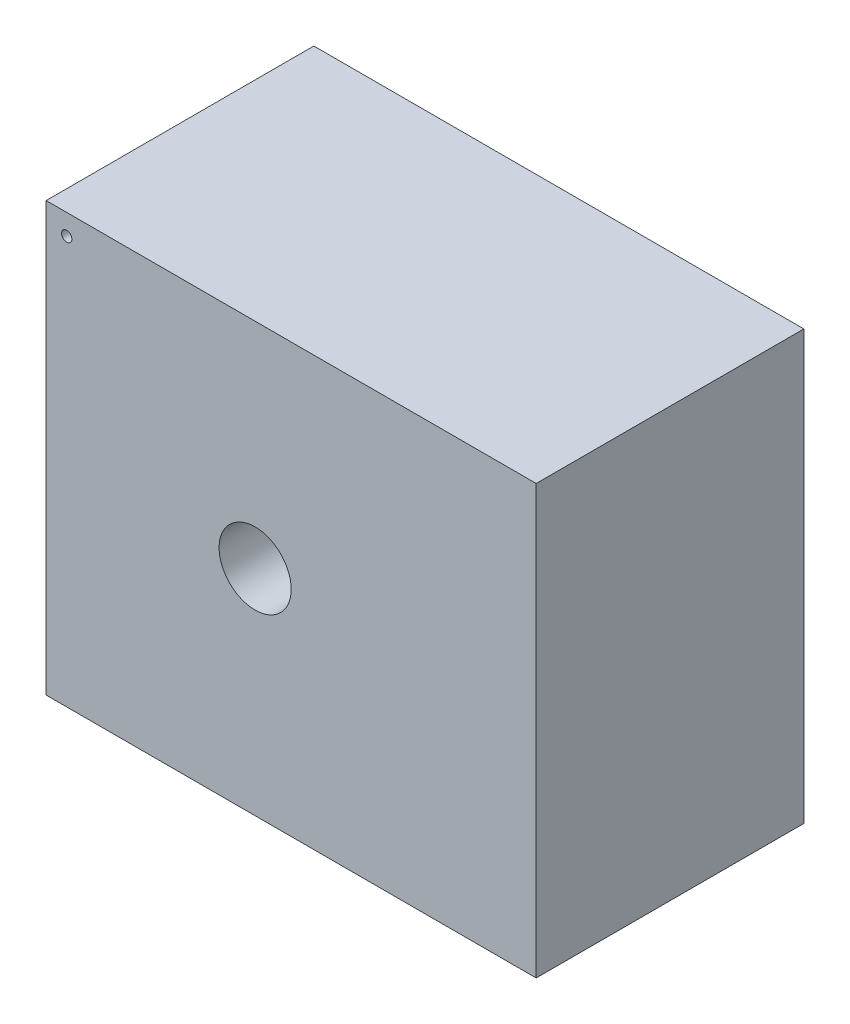
ISO-10303-21;
HEADER;
FILE_DESCRIPTION(('STEP AP214'),'2;1');
FILE_NAME('part.step','',(''),(''),'','','');
FILE_SCHEMA(('AUTOMOTIVE_DESIGN { 1 0 10303 214 1 1 1 1 }'));
ENDSEC;
DATA;
#1=APPLICATION_CONTEXT('core data for automotive mechanical design processes');
#2=APPLICATION_PROTOCOL_DEFINITION('international standard','automotive_design',2000,#1);
#3=PRODUCT_CONTEXT('',#1,'mechanical');
#4=PRODUCT('Part','Part','',(#3));
#5=PRODUCT_RELATED_PRODUCT_CATEGORY('part','',(#4));
#6=PRODUCT_DEFINITION_FORMATION('','',#4);
#7=PRODUCT_DEFINITION_CONTEXT('part definition',#1,'design');
#8=PRODUCT_DEFINITION('design','',#6,#7);
#9=PRODUCT_DEFINITION_SHAPE('','',#8);
#10=(LENGTH_UNIT() NAMED_UNIT(*) SI_UNIT(.MILLI.,.METRE.));
#11=(NAMED_UNIT(*) PLANE_ANGLE_UNIT() SI_UNIT($,.RADIAN.));
#12=(NAMED_UNIT(*) SI_UNIT($,.STERADIAN.) SOLID_ANGLE_UNIT());
#13=UNCERTAINTY_MEASURE_WITH_UNIT(LENGTH_MEASURE(1.E-05),#10,'distance_accuracy_value','');
#14=(GEOMETRIC_REPRESENTATION_CONTEXT(3) GLOBAL_UNCERTAINTY_ASSIGNED_CONTEXT((#13)) GLOBAL_UNIT_ASSIGNED_CONTEXT((#10,
#11,#12)) REPRESENTATION_CONTEXT('',''));
#15=CARTESIAN_POINT('',(0.,0.,0.));
#16=DIRECTION('',(0.,0.,1.));
#17=DIRECTION('',(1.,0.,0.));
#18=AXIS2_PLACEMENT_3D('',#15,#16,#17);
#19=CARTESIAN_POINT('',(35.,208.,-130.));
#20=DIRECTION('',(-1.,0.,0.));
#21=DIRECTION('',(0.,0.,1.));
#22=AXIS2_PLACEMENT_3D('',#19,#20,#21);
#23=PLANE('',#22);
#24=DIRECTION('',(0.,-1.,0.));
#25=VECTOR('',#24,1.);
#26=CARTESIAN_POINT('',(35.,208.,0.));
#27=LINE('',#26,#25);
#28=CARTESIAN_POINT('',(35.,208.,0.));
#29=VERTEX_POINT('',#28);
#30=CARTESIAN_POINT('',(35.,0.,0.));
#31=VERTEX_POINT('',#30);
#32=EDGE_CURVE('E98',#29,#31,#27,.T.);
#33=ORIENTED_EDGE('',*,*,#32,.F.);
#34=DIRECTION('',(0.,0.,1.));
#35=VECTOR('',#34,1.);
#36=CARTESIAN_POINT('',(35.,208.,-130.));
#37=LINE('',#36,#35);
#38=CARTESIAN_POINT('',(35.,208.,-130.));
#39=VERTEX_POINT('',#38);
#40=EDGE_CURVE('E11',#39,#29,#37,.T.);
#41=ORIENTED_EDGE('',*,*,#40,.F.);
#42=DIRECTION('',(0.,-1.,0.));
#43=VECTOR('',#42,1.);
#44=CARTESIAN_POINT('',(35.,208.,-130.));
#45=LINE('',#44,#43);
#46=CARTESIAN_POINT('',(35.,0.,-130.));
#47=VERTEX_POINT('',#46);
#48=EDGE_CURVE('E91',#39,#47,#45,.T.);
#49=ORIENTED_EDGE('',*,*,#48,.T.);
#50=DIRECTION('',(0.,0.,1.));
#51=VECTOR('',#50,1.);
#52=CARTESIAN_POINT('',(35.,0.,-130.));
#53=LINE('',#52,#51);
#54=EDGE_CURVE('E36',#47,#31,#53,.T.);
#55=ORIENTED_EDGE('',*,*,#54,.T.);
#56=EDGE_LOOP('',(#33,#41,#49,#55));
#57=FACE_BOUND('',#56,.T.);
#58=ADVANCED_FACE('F33',(#57),#23,.T.);
#59=CARTESIAN_POINT('',(273.,208.,-130.));
#60=DIRECTION('',(0.,1.,0.));
#61=DIRECTION('',(0.,0.,1.));
#62=AXIS2_PLACEMENT_3D('',#59,#60,#61);
#63=PLANE('',#62);
#64=DIRECTION('',(-1.,0.,0.));
#65=VECTOR('',#64,1.);
#66=CARTESIAN_POINT('',(273.,208.,0.));
#67=LINE('',#66,#65);
#68=CARTESIAN_POINT('',(273.,208.,0.));
#69=VERTEX_POINT('',#68);
#70=EDGE_CURVE('E93',#69,#29,#67,.T.);
#71=ORIENTED_EDGE('',*,*,#70,.F.);
#72=DIRECTION('',(0.,0.,1.));
#73=VECTOR('',#72,1.);
#74=CARTESIAN_POINT('',(273.,208.,-130.));
#75=LINE('',#74,#73);
#76=CARTESIAN_POINT('',(273.,208.,-130.));
#77=VERTEX_POINT('',#76);
#78=EDGE_CURVE('E42',#77,#69,#75,.T.);
#79=ORIENTED_EDGE('',*,*,#78,.F.);
#80=DIRECTION('',(-1.,0.,0.));
#81=VECTOR('',#80,1.);
#82=CARTESIAN_POINT('',(273.,208.,-130.));
#83=LINE('',#82,#81);
#84=EDGE_CURVE('E88',#77,#39,#83,.T.);
#85=ORIENTED_EDGE('',*,*,#84,.T.);
#86=ORIENTED_EDGE('',*,*,#40,.T.);
#87=EDGE_LOOP('',(#71,#79,#85,#86));
#88=FACE_BOUND('',#87,.T.);
#89=ADVANCED_FACE('F109',(#88),#63,.T.);
#90=CARTESIAN_POINT('',(273.,0.,-130.));
#91=DIRECTION('',(1.,0.,0.));
#92=DIRECTION('',(0.,0.,-1.));
#93=AXIS2_PLACEMENT_3D('',#90,#91,#92);
#94=PLANE('',#93);
#95=DIRECTION('',(0.,1.,0.));
#96=VECTOR('',#95,1.);
#97=CARTESIAN_POINT('',(273.,0.,0.));
#98=LINE('',#97,#96);
#99=CARTESIAN_POINT('',(273.,0.,0.));
#100=VERTEX_POINT('',#99);
#101=EDGE_CURVE('E83',#100,#69,#98,.T.);
#102=ORIENTED_EDGE('',*,*,#101,.F.);
#103=DIRECTION('',(0.,0.,1.));
#104=VECTOR('',#103,1.);
#105=CARTESIAN_POINT('',(273.,0.,-130.));
#106=LINE('',#105,#104);
#107=CARTESIAN_POINT('',(273.,0.,-130.));
#108=VERTEX_POINT('',#107);
#109=EDGE_CURVE('E78',#108,#100,#106,.T.);
#110=ORIENTED_EDGE('',*,*,#109,.F.);
#111=DIRECTION('',(0.,1.,0.));
#112=VECTOR('',#111,1.);
#113=CARTESIAN_POINT('',(273.,0.,-130.));
#114=LINE('',#113,#112);
#115=EDGE_CURVE('E81',#108,#77,#114,.T.);
#116=ORIENTED_EDGE('',*,*,#115,.T.);
#117=ORIENTED_EDGE('',*,*,#78,.T.);
#118=EDGE_LOOP('',(#102,#110,#116,#117));
#119=FACE_BOUND('',#118,.T.);
#120=ADVANCED_FACE('F80',(#119),#94,.T.);
#121=CARTESIAN_POINT('',(35.,0.,-130.));
#122=DIRECTION('',(0.,-1.,0.));
#123=DIRECTION('',(1.,0.,0.));
#124=AXIS2_PLACEMENT_3D('',#121,#122,#123);
#125=PLANE('',#124);
#126=DIRECTION('',(1.,0.,0.));
#127=VECTOR('',#126,1.);
#128=CARTESIAN_POINT('',(35.,0.,0.));
#129=LINE('',#128,#127);
#130=EDGE_CURVE('E101',#31,#100,#129,.T.);
#131=ORIENTED_EDGE('',*,*,#130,.F.);
#132=ORIENTED_EDGE('',*,*,#54,.F.);
#133=DIRECTION('',(1.,0.,0.));
#134=VECTOR('',#133,1.);
#135=CARTESIAN_POINT('',(35.,0.,-130.));
#136=LINE('',#135,#134);
#137=EDGE_CURVE('E87',#47,#108,#136,.T.);
#138=ORIENTED_EDGE('',*,*,#137,.T.);
#139=ORIENTED_EDGE('',*,*,#109,.T.);
#140=EDGE_LOOP('',(#131,#132,#138,#139));
#141=FACE_BOUND('',#140,.T.);
#142=ADVANCED_FACE('F90',(#141),#125,.T.);
#143=CARTESIAN_POINT('',(0.,0.,-130.));
#144=DIRECTION('',(0.,0.,1.));
#145=DIRECTION('',(1.,0.,0.));
#146=AXIS2_PLACEMENT_3D('',#143,#144,#145);
#147=PLANE('',#146);
#148=CARTESIAN_POINT('',(45.,198.,-130.));
#149=DIRECTION('',(0.,0.,1.));
#150=DIRECTION('',(1.,0.,0.));
#151=AXIS2_PLACEMENT_3D('',#148,#149,#150);
#152=CIRCLE('',#151,2.5);
#153=CARTESIAN_POINT('',(47.5,198.,-130.));
#154=VERTEX_POINT('',#153);
#155=EDGE_CURVE('E142',#154,#154,#152,.T.);
#156=ORIENTED_EDGE('',*,*,#155,.T.);
#157=EDGE_LOOP('',(#156));
#158=FACE_BOUND('',#157,.T.);
#159=CARTESIAN_POINT('',(136.5,104.,-130.));
#160=DIRECTION('',(0.,0.,1.));
#161=DIRECTION('',(1.,0.,0.));
#162=AXIS2_PLACEMENT_3D('',#159,#160,#161);
#163=CIRCLE('',#162,17.5);
#164=CARTESIAN_POINT('',(154.,104.,-130.));
#165=VERTEX_POINT('',#164);
#166=EDGE_CURVE('E102',#165,#165,#163,.T.);
#167=ORIENTED_EDGE('',*,*,#166,.T.);
#168=EDGE_LOOP('',(#167));
#169=FACE_BOUND('',#168,.T.);
#170=ORIENTED_EDGE('',*,*,#48,.F.);
#171=ORIENTED_EDGE('',*,*,#84,.F.);
#172=ORIENTED_EDGE('',*,*,#115,.F.);
#173=ORIENTED_EDGE('',*,*,#137,.F.);
#174=EDGE_LOOP('',(#170,#171,#172,#173));
#175=FACE_BOUND('',#174,.T.);
#176=ADVANCED_FACE('F86',(#158,#169,#175),#147,.F.);
#177=CARTESIAN_POINT('',(0.,0.,0.));
#178=DIRECTION('',(0.,0.,1.));
#179=DIRECTION('',(1.,0.,0.));
#180=AXIS2_PLACEMENT_3D('',#177,#178,#179);
#181=PLANE('',#180);
#182=CARTESIAN_POINT('',(45.,198.,0.));
#183=DIRECTION('',(0.,0.,1.));
#184=DIRECTION('',(1.,0.,0.));
#185=AXIS2_PLACEMENT_3D('',#182,#183,#184);
#186=CIRCLE('',#185,2.5);
#187=CARTESIAN_POINT('',(47.5,198.,0.));
#188=VERTEX_POINT('',#187);
#189=EDGE_CURVE('E145',#188,#188,#186,.T.);
#190=ORIENTED_EDGE('',*,*,#189,.F.);
#191=EDGE_LOOP('',(#190));
#192=FACE_BOUND('',#191,.T.);
#193=CARTESIAN_POINT('',(136.5,104.,0.));
#194=DIRECTION('',(0.,0.,1.));
#195=DIRECTION('',(1.,0.,0.));
#196=AXIS2_PLACEMENT_3D('',#193,#194,#195);
#197=CIRCLE('',#196,17.5);
#198=CARTESIAN_POINT('',(154.,104.,0.));
#199=VERTEX_POINT('',#198);
#200=EDGE_CURVE('E147',#199,#199,#197,.T.);
#201=ORIENTED_EDGE('',*,*,#200,.F.);
#202=EDGE_LOOP('',(#201));
#203=FACE_BOUND('',#202,.T.);
#204=ORIENTED_EDGE('',*,*,#32,.T.);
#205=ORIENTED_EDGE('',*,*,#130,.T.);
#206=ORIENTED_EDGE('',*,*,#101,.T.);
#207=ORIENTED_EDGE('',*,*,#70,.T.);
#208=EDGE_LOOP('',(#204,#205,#206,#207));
#209=FACE_BOUND('',#208,.T.);
#210=ADVANCED_FACE('F108',(#192,#203,#209),#181,.T.);
#211=CARTESIAN_POINT('',(136.5,104.,-130.));
#212=DIRECTION('',(0.,0.,1.));
#213=DIRECTION('',(1.,0.,0.));
#214=AXIS2_PLACEMENT_3D('',#211,#212,#213);
#215=CYLINDRICAL_SURFACE('',#214,17.5);
#216=ORIENTED_EDGE('',*,*,#166,.F.);
#217=EDGE_LOOP('',(#216));
#218=FACE_BOUND('',#217,.T.);
#219=ORIENTED_EDGE('',*,*,#200,.T.);
#220=EDGE_LOOP('',(#219));
#221=FACE_BOUND('',#220,.T.);
#222=ADVANCED_FACE('F127',(#218,#221),#215,.F.);
#223=CARTESIAN_POINT('',(45.,198.,-130.));
#224=DIRECTION('',(0.,0.,1.));
#225=DIRECTION('',(1.,0.,0.));
#226=AXIS2_PLACEMENT_3D('',#223,#224,#225);
#227=CYLINDRICAL_SURFACE('',#226,2.5);
#228=ORIENTED_EDGE('',*,*,#155,.F.);
#229=EDGE_LOOP('',(#228));
#230=FACE_BOUND('',#229,.T.);
#231=ORIENTED_EDGE('',*,*,#189,.T.);
#232=EDGE_LOOP('',(#231));
#233=FACE_BOUND('',#232,.T.);
#234=ADVANCED_FACE('F134',(#230,#233),#227,.F.);
#235=CLOSED_SHELL('',(#58,#89,#120,#142,#176,#210,#222,#234));
#236=MANIFOLD_SOLID_BREP('B2',#235);
#237=ADVANCED_BREP_SHAPE_REPRESENTATION('',(#18,#236),#14);
#238=SHAPE_DEFINITION_REPRESENTATION(#9,#237);
ENDSEC;
END-ISO-10303-21;
